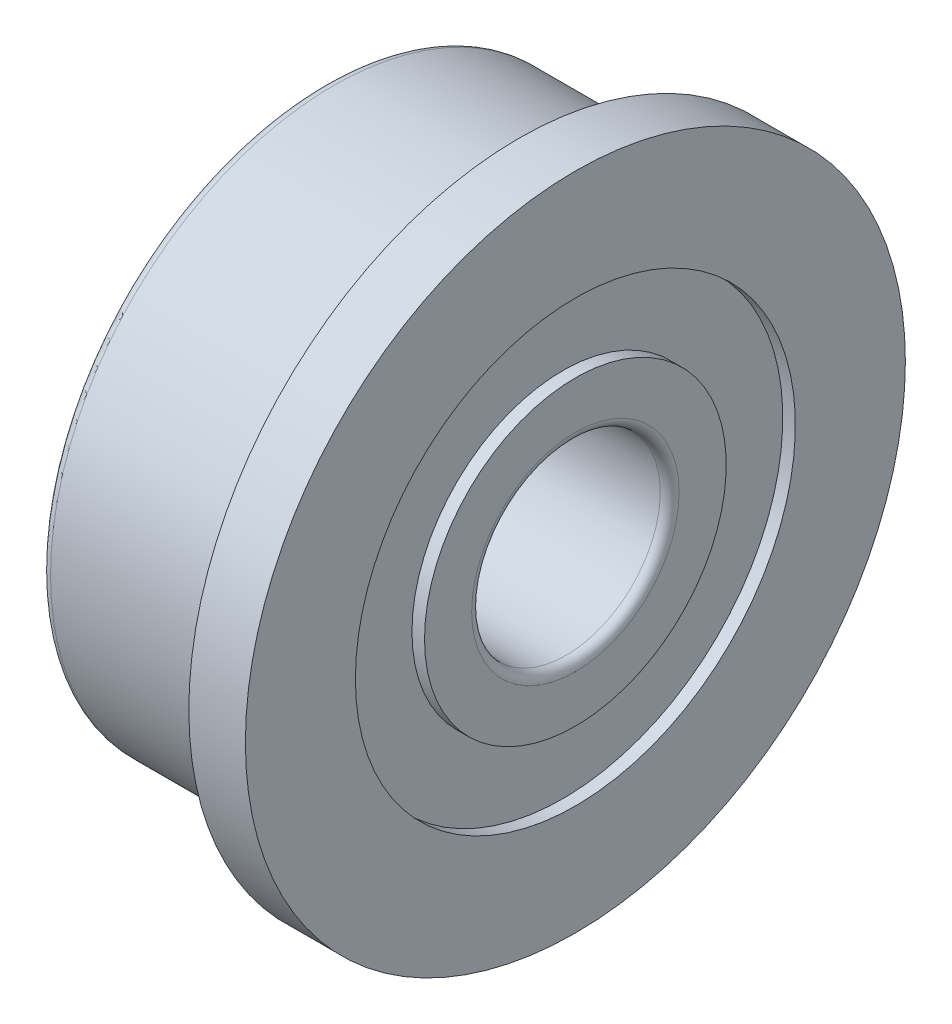
ISO-10303-21;
HEADER;
FILE_DESCRIPTION(('STEP AP214'),'2;1');
FILE_NAME('part.step','',(''),(''),'','','');
FILE_SCHEMA(('AUTOMOTIVE_DESIGN { 1 0 10303 214 1 1 1 1 }'));
ENDSEC;
DATA;
#1=APPLICATION_CONTEXT('core data for automotive mechanical design processes');
#2=APPLICATION_PROTOCOL_DEFINITION('international standard','automotive_design',2000,#1);
#3=PRODUCT_CONTEXT('',#1,'mechanical');
#4=PRODUCT('Part','Part','',(#3));
#5=PRODUCT_RELATED_PRODUCT_CATEGORY('part','',(#4));
#6=PRODUCT_DEFINITION_FORMATION('','',#4);
#7=PRODUCT_DEFINITION_CONTEXT('part definition',#1,'design');
#8=PRODUCT_DEFINITION('design','',#6,#7);
#9=PRODUCT_DEFINITION_SHAPE('','',#8);
#10=(LENGTH_UNIT() NAMED_UNIT(*) SI_UNIT(.MILLI.,.METRE.));
#11=(NAMED_UNIT(*) PLANE_ANGLE_UNIT() SI_UNIT($,.RADIAN.));
#12=(NAMED_UNIT(*) SI_UNIT($,.STERADIAN.) SOLID_ANGLE_UNIT());
#13=UNCERTAINTY_MEASURE_WITH_UNIT(LENGTH_MEASURE(1.E-05),#10,'distance_accuracy_value','');
#14=(GEOMETRIC_REPRESENTATION_CONTEXT(3) GLOBAL_UNCERTAINTY_ASSIGNED_CONTEXT((#13)) GLOBAL_UNIT_ASSIGNED_CONTEXT((#10,
#11,#12)) REPRESENTATION_CONTEXT('',''));
#15=CARTESIAN_POINT('',(0.,0.,0.));
#16=DIRECTION('',(0.,0.,1.));
#17=DIRECTION('',(1.,0.,0.));
#18=AXIS2_PLACEMENT_3D('',#15,#16,#17);
#19=CARTESIAN_POINT('',(-3.1,0.,0.));
#20=DIRECTION('',(-1.,0.,0.));
#21=DIRECTION('',(0.,0.,1.));
#22=AXIS2_PLACEMENT_3D('',#19,#20,#21);
#23=CYLINDRICAL_SURFACE('',#22,5.25);
#24=CARTESIAN_POINT('',(0.,0.,0.));
#25=DIRECTION('',(-1.,0.,0.));
#26=DIRECTION('',(0.,0.,1.));
#27=AXIS2_PLACEMENT_3D('',#24,#25,#26);
#28=CIRCLE('',#27,5.25);
#29=CARTESIAN_POINT('',(0.,0.,5.25));
#30=VERTEX_POINT('',#29);
#31=EDGE_CURVE('E59',#30,#30,#28,.T.);
#32=ORIENTED_EDGE('',*,*,#31,.F.);
#33=EDGE_LOOP('',(#32));
#34=FACE_BOUND('',#33,.T.);
#35=CARTESIAN_POINT('',(0.9,0.,0.));
#36=DIRECTION('',(-1.,0.,0.));
#37=DIRECTION('',(0.,0.,1.));
#38=AXIS2_PLACEMENT_3D('',#35,#36,#37);
#39=CIRCLE('',#38,5.25);
#40=CARTESIAN_POINT('',(0.9,0.,5.25));
#41=VERTEX_POINT('',#40);
#42=EDGE_CURVE('E92',#41,#41,#39,.T.);
#43=ORIENTED_EDGE('',*,*,#42,.T.);
#44=EDGE_LOOP('',(#43));
#45=FACE_BOUND('',#44,.T.);
#46=ADVANCED_FACE('F33',(#34,#45),#23,.T.);
#47=CARTESIAN_POINT('',(0.,4.7,0.));
#48=DIRECTION('',(1.,0.,0.));
#49=DIRECTION('',(0.,0.,-1.));
#50=AXIS2_PLACEMENT_3D('',#47,#48,#49);
#51=PLANE('',#50);
#52=CARTESIAN_POINT('',(0.,0.,0.));
#53=DIRECTION('',(-1.,0.,0.));
#54=DIRECTION('',(0.,0.,1.));
#55=AXIS2_PLACEMENT_3D('',#52,#53,#54);
#56=CIRCLE('',#55,4.7);
#57=CARTESIAN_POINT('',(0.,0.,4.7));
#58=VERTEX_POINT('',#57);
#59=EDGE_CURVE('E62',#58,#58,#56,.T.);
#60=ORIENTED_EDGE('',*,*,#59,.F.);
#61=EDGE_LOOP('',(#60));
#62=FACE_BOUND('',#61,.T.);
#63=ORIENTED_EDGE('',*,*,#31,.T.);
#64=EDGE_LOOP('',(#63));
#65=FACE_BOUND('',#64,.T.);
#66=ADVANCED_FACE('F134',(#62,#65),#51,.F.);
#67=CARTESIAN_POINT('',(0.,0.,0.));
#68=DIRECTION('',(-1.,0.,0.));
#69=DIRECTION('',(0.,0.,1.));
#70=AXIS2_PLACEMENT_3D('',#67,#68,#69);
#71=TOROIDAL_SURFACE('',#70,4.5,0.2);
#72=CARTESIAN_POINT('',(-0.2,0.,0.));
#73=DIRECTION('',(-1.,0.,0.));
#74=DIRECTION('',(0.,0.,1.));
#75=AXIS2_PLACEMENT_3D('',#72,#73,#74);
#76=CIRCLE('',#75,4.5);
#77=CARTESIAN_POINT('',(-0.2,0.,4.5));
#78=VERTEX_POINT('',#77);
#79=EDGE_CURVE('E65',#78,#78,#76,.T.);
#80=ORIENTED_EDGE('',*,*,#79,.F.);
#81=EDGE_LOOP('',(#80));
#82=FACE_BOUND('',#81,.T.);
#83=ORIENTED_EDGE('',*,*,#59,.T.);
#84=EDGE_LOOP('',(#83));
#85=FACE_BOUND('',#84,.T.);
#86=ADVANCED_FACE('F140',(#82,#85),#71,.F.);
#87=CARTESIAN_POINT('',(-3.1,0.,0.));
#88=DIRECTION('',(-1.,0.,0.));
#89=DIRECTION('',(0.,0.,1.));
#90=AXIS2_PLACEMENT_3D('',#87,#88,#89);
#91=CYLINDRICAL_SURFACE('',#90,4.5);
#92=CARTESIAN_POINT('',(-2.95,0.,0.));
#93=DIRECTION('',(1.,0.,0.));
#94=DIRECTION('',(0.,0.,-1.));
#95=AXIS2_PLACEMENT_3D('',#92,#93,#94);
#96=CIRCLE('',#95,4.5);
#97=CARTESIAN_POINT('',(-2.95,0.,-4.5));
#98=VERTEX_POINT('',#97);
#99=EDGE_CURVE('E10',#98,#98,#96,.T.);
#100=ORIENTED_EDGE('',*,*,#99,.T.);
#101=EDGE_LOOP('',(#100));
#102=FACE_BOUND('',#101,.T.);
#103=ORIENTED_EDGE('',*,*,#79,.T.);
#104=EDGE_LOOP('',(#103));
#105=FACE_BOUND('',#104,.T.);
#106=ADVANCED_FACE('F185',(#102,#105),#91,.T.);
#107=CARTESIAN_POINT('',(-3.1,3.5,0.));
#108=DIRECTION('',(1.,0.,0.));
#109=DIRECTION('',(0.,0.,-1.));
#110=AXIS2_PLACEMENT_3D('',#107,#108,#109);
#111=PLANE('',#110);
#112=CARTESIAN_POINT('',(-3.1,0.,0.));
#113=DIRECTION('',(1.,0.,0.));
#114=DIRECTION('',(0.,0.,-1.));
#115=AXIS2_PLACEMENT_3D('',#112,#113,#114);
#116=CIRCLE('',#115,4.35);
#117=CARTESIAN_POINT('',(-3.1,0.,-4.35));
#118=VERTEX_POINT('',#117);
#119=EDGE_CURVE('E40',#118,#118,#116,.F.);
#120=ORIENTED_EDGE('',*,*,#119,.T.);
#121=EDGE_LOOP('',(#120));
#122=FACE_BOUND('',#121,.T.);
#123=CARTESIAN_POINT('',(-3.1,0.,0.));
#124=DIRECTION('',(-1.,0.,0.));
#125=DIRECTION('',(0.,0.,1.));
#126=AXIS2_PLACEMENT_3D('',#123,#124,#125);
#127=CIRCLE('',#126,3.5);
#128=CARTESIAN_POINT('',(-3.1,0.,3.5));
#129=VERTEX_POINT('',#128);
#130=EDGE_CURVE('E68',#129,#129,#127,.T.);
#131=ORIENTED_EDGE('',*,*,#130,.F.);
#132=EDGE_LOOP('',(#131));
#133=FACE_BOUND('',#132,.T.);
#134=ADVANCED_FACE('F180',(#122,#133),#111,.F.);
#135=CARTESIAN_POINT('',(-3.1,0.,0.));
#136=DIRECTION('',(-1.,0.,0.));
#137=DIRECTION('',(0.,0.,1.));
#138=AXIS2_PLACEMENT_3D('',#135,#136,#137);
#139=CYLINDRICAL_SURFACE('',#138,3.5);
#140=CARTESIAN_POINT('',(-2.9,0.,0.));
#141=DIRECTION('',(-1.,0.,0.));
#142=DIRECTION('',(0.,0.,1.));
#143=AXIS2_PLACEMENT_3D('',#140,#141,#142);
#144=CIRCLE('',#143,3.5);
#145=CARTESIAN_POINT('',(-2.9,0.,3.5));
#146=VERTEX_POINT('',#145);
#147=EDGE_CURVE('E71',#146,#146,#144,.T.);
#148=ORIENTED_EDGE('',*,*,#147,.F.);
#149=EDGE_LOOP('',(#148));
#150=FACE_BOUND('',#149,.T.);
#151=ORIENTED_EDGE('',*,*,#130,.T.);
#152=EDGE_LOOP('',(#151));
#153=FACE_BOUND('',#152,.T.);
#154=ADVANCED_FACE('F174',(#150,#153),#139,.F.);
#155=CARTESIAN_POINT('',(-2.9,3.5,0.));
#156=DIRECTION('',(1.,0.,0.));
#157=DIRECTION('',(0.,0.,-1.));
#158=AXIS2_PLACEMENT_3D('',#155,#156,#157);
#159=PLANE('',#158);
#160=CARTESIAN_POINT('',(-2.9,0.,0.));
#161=DIRECTION('',(-1.,0.,0.));
#162=DIRECTION('',(0.,0.,1.));
#163=AXIS2_PLACEMENT_3D('',#160,#161,#162);
#164=CIRCLE('',#163,2.4);
#165=CARTESIAN_POINT('',(-2.9,0.,2.4));
#166=VERTEX_POINT('',#165);
#167=EDGE_CURVE('E74',#166,#166,#164,.T.);
#168=ORIENTED_EDGE('',*,*,#167,.F.);
#169=EDGE_LOOP('',(#168));
#170=FACE_BOUND('',#169,.T.);
#171=ORIENTED_EDGE('',*,*,#147,.T.);
#172=EDGE_LOOP('',(#171));
#173=FACE_BOUND('',#172,.T.);
#174=ADVANCED_FACE('F168',(#170,#173),#159,.F.);
#175=CARTESIAN_POINT('',(-3.1,0.,0.));
#176=DIRECTION('',(-1.,0.,0.));
#177=DIRECTION('',(0.,0.,1.));
#178=AXIS2_PLACEMENT_3D('',#175,#176,#177);
#179=CYLINDRICAL_SURFACE('',#178,2.4);
#180=CARTESIAN_POINT('',(-3.1,0.,0.));
#181=DIRECTION('',(-1.,0.,0.));
#182=DIRECTION('',(0.,0.,1.));
#183=AXIS2_PLACEMENT_3D('',#180,#181,#182);
#184=CIRCLE('',#183,2.4);
#185=CARTESIAN_POINT('',(-3.1,0.,2.4));
#186=VERTEX_POINT('',#185);
#187=EDGE_CURVE('E77',#186,#186,#184,.T.);
#188=ORIENTED_EDGE('',*,*,#187,.F.);
#189=EDGE_LOOP('',(#188));
#190=FACE_BOUND('',#189,.T.);
#191=ORIENTED_EDGE('',*,*,#167,.T.);
#192=EDGE_LOOP('',(#191));
#193=FACE_BOUND('',#192,.T.);
#194=ADVANCED_FACE('F162',(#190,#193),#179,.T.);
#195=CARTESIAN_POINT('',(-3.1,1.5,0.));
#196=DIRECTION('',(1.,0.,0.));
#197=DIRECTION('',(0.,0.,-1.));
#198=AXIS2_PLACEMENT_3D('',#195,#196,#197);
#199=PLANE('',#198);
#200=CARTESIAN_POINT('',(-3.1,0.,0.));
#201=DIRECTION('',(1.,0.,0.));
#202=DIRECTION('',(0.,0.,-1.));
#203=AXIS2_PLACEMENT_3D('',#200,#201,#202);
#204=CIRCLE('',#203,1.65);
#205=CARTESIAN_POINT('',(-3.1,0.,-1.65));
#206=VERTEX_POINT('',#205);
#207=EDGE_CURVE('E44',#206,#206,#204,.T.);
#208=ORIENTED_EDGE('',*,*,#207,.T.);
#209=EDGE_LOOP('',(#208));
#210=FACE_BOUND('',#209,.T.);
#211=ORIENTED_EDGE('',*,*,#187,.T.);
#212=EDGE_LOOP('',(#211));
#213=FACE_BOUND('',#212,.T.);
#214=ADVANCED_FACE('F130',(#210,#213),#199,.F.);
#215=CARTESIAN_POINT('',(-3.1,0.,0.));
#216=DIRECTION('',(-1.,0.,0.));
#217=DIRECTION('',(0.,0.,1.));
#218=AXIS2_PLACEMENT_3D('',#215,#216,#217);
#219=CYLINDRICAL_SURFACE('',#218,1.5);
#220=CARTESIAN_POINT('',(0.75,0.,0.));
#221=DIRECTION('',(-1.,0.,0.));
#222=DIRECTION('',(0.,0.,1.));
#223=AXIS2_PLACEMENT_3D('',#220,#221,#222);
#224=CIRCLE('',#223,1.5);
#225=CARTESIAN_POINT('',(0.75,0.,1.5));
#226=VERTEX_POINT('',#225);
#227=EDGE_CURVE('E48',#226,#226,#224,.F.);
#228=ORIENTED_EDGE('',*,*,#227,.T.);
#229=EDGE_LOOP('',(#228));
#230=FACE_BOUND('',#229,.T.);
#231=CARTESIAN_POINT('',(-2.95,0.,0.));
#232=DIRECTION('',(1.,0.,0.));
#233=DIRECTION('',(0.,0.,-1.));
#234=AXIS2_PLACEMENT_3D('',#231,#232,#233);
#235=CIRCLE('',#234,1.5);
#236=CARTESIAN_POINT('',(-2.95,0.,-1.5));
#237=VERTEX_POINT('',#236);
#238=EDGE_CURVE('E53',#237,#237,#235,.F.);
#239=ORIENTED_EDGE('',*,*,#238,.T.);
#240=EDGE_LOOP('',(#239));
#241=FACE_BOUND('',#240,.T.);
#242=ADVANCED_FACE('F124',(#230,#241),#219,.F.);
#243=CARTESIAN_POINT('',(0.9,2.4,0.));
#244=DIRECTION('',(-1.,0.,0.));
#245=DIRECTION('',(0.,0.,1.));
#246=AXIS2_PLACEMENT_3D('',#243,#244,#245);
#247=PLANE('',#246);
#248=CARTESIAN_POINT('',(0.9,0.,0.));
#249=DIRECTION('',(-1.,0.,0.));
#250=DIRECTION('',(0.,0.,1.));
#251=AXIS2_PLACEMENT_3D('',#248,#249,#250);
#252=CIRCLE('',#251,1.65);
#253=CARTESIAN_POINT('',(0.9,0.,1.65));
#254=VERTEX_POINT('',#253);
#255=EDGE_CURVE('E56',#254,#254,#252,.T.);
#256=ORIENTED_EDGE('',*,*,#255,.T.);
#257=EDGE_LOOP('',(#256));
#258=FACE_BOUND('',#257,.T.);
#259=CARTESIAN_POINT('',(0.9,0.,0.));
#260=DIRECTION('',(-1.,0.,0.));
#261=DIRECTION('',(0.,0.,1.));
#262=AXIS2_PLACEMENT_3D('',#259,#260,#261);
#263=CIRCLE('',#262,2.4);
#264=CARTESIAN_POINT('',(0.9,0.,2.4));
#265=VERTEX_POINT('',#264);
#266=EDGE_CURVE('E80',#265,#265,#263,.T.);
#267=ORIENTED_EDGE('',*,*,#266,.F.);
#268=EDGE_LOOP('',(#267));
#269=FACE_BOUND('',#268,.T.);
#270=ADVANCED_FACE('F119',(#258,#269),#247,.F.);
#271=CARTESIAN_POINT('',(-3.1,0.,0.));
#272=DIRECTION('',(-1.,0.,0.));
#273=DIRECTION('',(0.,0.,1.));
#274=AXIS2_PLACEMENT_3D('',#271,#272,#273);
#275=CYLINDRICAL_SURFACE('',#274,2.4);
#276=CARTESIAN_POINT('',(0.699999999999999,0.,0.));
#277=DIRECTION('',(-1.,0.,0.));
#278=DIRECTION('',(0.,0.,1.));
#279=AXIS2_PLACEMENT_3D('',#276,#277,#278);
#280=CIRCLE('',#279,2.4);
#281=CARTESIAN_POINT('',(0.699999999999999,0.,2.4));
#282=VERTEX_POINT('',#281);
#283=EDGE_CURVE('E83',#282,#282,#280,.T.);
#284=ORIENTED_EDGE('',*,*,#283,.F.);
#285=EDGE_LOOP('',(#284));
#286=FACE_BOUND('',#285,.T.);
#287=ORIENTED_EDGE('',*,*,#266,.T.);
#288=EDGE_LOOP('',(#287));
#289=FACE_BOUND('',#288,.T.);
#290=ADVANCED_FACE('F113',(#286,#289),#275,.T.);
#291=CARTESIAN_POINT('',(0.699999999999999,3.5,0.));
#292=DIRECTION('',(-1.,0.,0.));
#293=DIRECTION('',(0.,0.,1.));
#294=AXIS2_PLACEMENT_3D('',#291,#292,#293);
#295=PLANE('',#294);
#296=CARTESIAN_POINT('',(0.699999999999999,0.,0.));
#297=DIRECTION('',(-1.,0.,0.));
#298=DIRECTION('',(0.,0.,1.));
#299=AXIS2_PLACEMENT_3D('',#296,#297,#298);
#300=CIRCLE('',#299,3.5);
#301=CARTESIAN_POINT('',(0.699999999999999,0.,3.5));
#302=VERTEX_POINT('',#301);
#303=EDGE_CURVE('E86',#302,#302,#300,.T.);
#304=ORIENTED_EDGE('',*,*,#303,.F.);
#305=EDGE_LOOP('',(#304));
#306=FACE_BOUND('',#305,.T.);
#307=ORIENTED_EDGE('',*,*,#283,.T.);
#308=EDGE_LOOP('',(#307));
#309=FACE_BOUND('',#308,.T.);
#310=ADVANCED_FACE('F107',(#306,#309),#295,.F.);
#311=CARTESIAN_POINT('',(-3.1,0.,0.));
#312=DIRECTION('',(-1.,0.,0.));
#313=DIRECTION('',(0.,0.,1.));
#314=AXIS2_PLACEMENT_3D('',#311,#312,#313);
#315=CYLINDRICAL_SURFACE('',#314,3.5);
#316=CARTESIAN_POINT('',(0.9,0.,0.));
#317=DIRECTION('',(-1.,0.,0.));
#318=DIRECTION('',(0.,0.,1.));
#319=AXIS2_PLACEMENT_3D('',#316,#317,#318);
#320=CIRCLE('',#319,3.5);
#321=CARTESIAN_POINT('',(0.9,0.,3.5));
#322=VERTEX_POINT('',#321);
#323=EDGE_CURVE('E89',#322,#322,#320,.T.);
#324=ORIENTED_EDGE('',*,*,#323,.F.);
#325=EDGE_LOOP('',(#324));
#326=FACE_BOUND('',#325,.T.);
#327=ORIENTED_EDGE('',*,*,#303,.T.);
#328=EDGE_LOOP('',(#327));
#329=FACE_BOUND('',#328,.T.);
#330=ADVANCED_FACE('F101',(#326,#329),#315,.F.);
#331=CARTESIAN_POINT('',(0.9,5.25,0.));
#332=DIRECTION('',(-1.,0.,0.));
#333=DIRECTION('',(0.,0.,1.));
#334=AXIS2_PLACEMENT_3D('',#331,#332,#333);
#335=PLANE('',#334);
#336=ORIENTED_EDGE('',*,*,#42,.F.);
#337=EDGE_LOOP('',(#336));
#338=FACE_BOUND('',#337,.T.);
#339=ORIENTED_EDGE('',*,*,#323,.T.);
#340=EDGE_LOOP('',(#339));
#341=FACE_BOUND('',#340,.T.);
#342=ADVANCED_FACE('F97',(#338,#341),#335,.F.);
#343=CARTESIAN_POINT('',(0.75,0.,0.));
#344=DIRECTION('',(-1.,0.,0.));
#345=DIRECTION('',(0.,0.,1.));
#346=AXIS2_PLACEMENT_3D('',#343,#344,#345);
#347=TOROIDAL_SURFACE('',#346,1.65,0.15);
#348=ORIENTED_EDGE('',*,*,#227,.F.);
#349=EDGE_LOOP('',(#348));
#350=FACE_BOUND('',#349,.T.);
#351=ORIENTED_EDGE('',*,*,#255,.F.);
#352=EDGE_LOOP('',(#351));
#353=FACE_BOUND('',#352,.T.);
#354=ADVANCED_FACE('F100',(#350,#353),#347,.T.);
#355=CARTESIAN_POINT('',(-2.95,0.,0.));
#356=DIRECTION('',(1.,0.,0.));
#357=DIRECTION('',(0.,0.,-1.));
#358=AXIS2_PLACEMENT_3D('',#355,#356,#357);
#359=TOROIDAL_SURFACE('',#358,1.65,0.15);
#360=ORIENTED_EDGE('',*,*,#207,.F.);
#361=EDGE_LOOP('',(#360));
#362=FACE_BOUND('',#361,.T.);
#363=ORIENTED_EDGE('',*,*,#238,.F.);
#364=EDGE_LOOP('',(#363));
#365=FACE_BOUND('',#364,.T.);
#366=ADVANCED_FACE('F147',(#362,#365),#359,.T.);
#367=CARTESIAN_POINT('',(-2.95,0.,0.));
#368=DIRECTION('',(1.,0.,0.));
#369=DIRECTION('',(0.,0.,-1.));
#370=AXIS2_PLACEMENT_3D('',#367,#368,#369);
#371=TOROIDAL_SURFACE('',#370,4.35,0.15);
#372=ORIENTED_EDGE('',*,*,#99,.F.);
#373=EDGE_LOOP('',(#372));
#374=FACE_BOUND('',#373,.T.);
#375=ORIENTED_EDGE('',*,*,#119,.F.);
#376=EDGE_LOOP('',(#375));
#377=FACE_BOUND('',#376,.T.);
#378=ADVANCED_FACE('F35',(#374,#377),#371,.T.);
#379=CLOSED_SHELL('',(#46,#66,#86,#106,#134,#154,#174,#194,#214,#242,#270,#290,#310,#330,#342,
#354,#366,#378));
#380=MANIFOLD_SOLID_BREP('B2',#379);
#381=ADVANCED_BREP_SHAPE_REPRESENTATION('',(#18,#380),#14);
#382=SHAPE_DEFINITION_REPRESENTATION(#9,#381);
ENDSEC;
END-ISO-10303-21;
